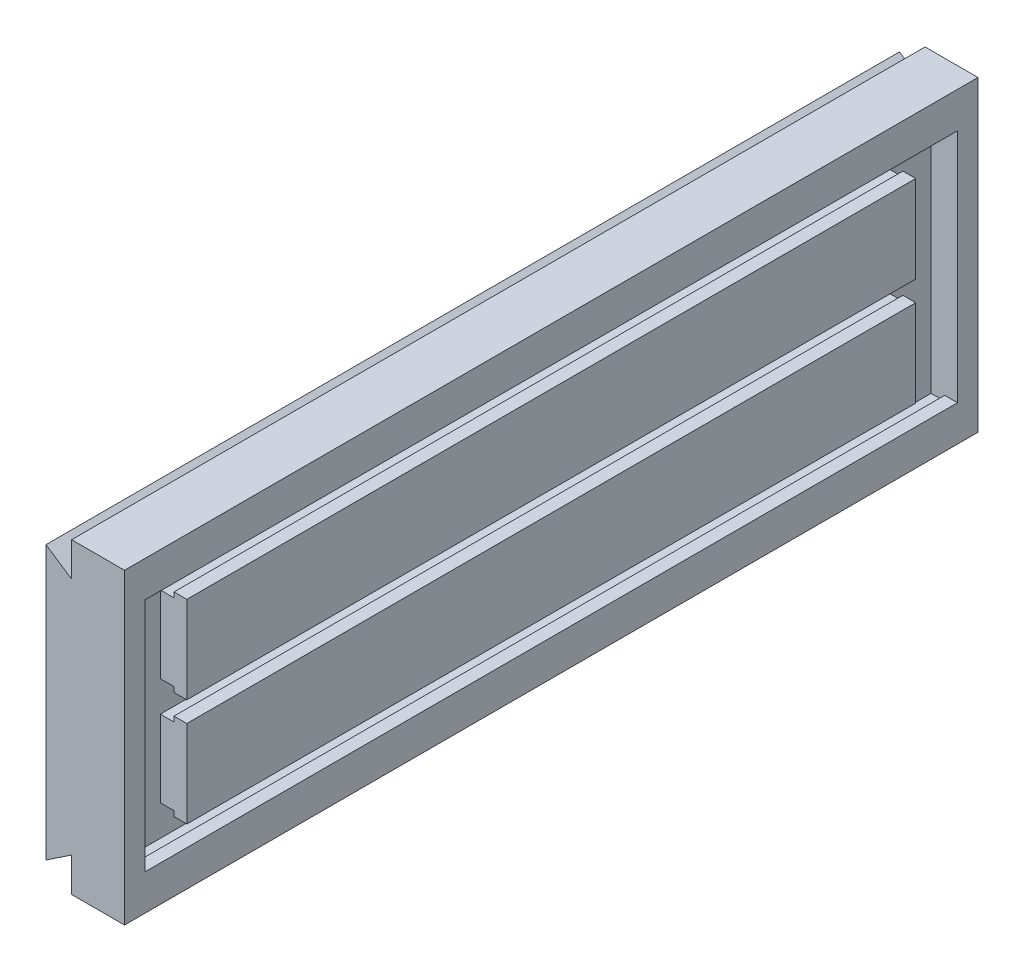
ISO-10303-21;
HEADER;
FILE_DESCRIPTION(('STEP AP214'),'2;1');
FILE_NAME('part.step','',(''),(''),'','','');
FILE_SCHEMA(('AUTOMOTIVE_DESIGN { 1 0 10303 214 1 1 1 1 }'));
ENDSEC;
DATA;
#1=APPLICATION_CONTEXT('core data for automotive mechanical design processes');
#2=APPLICATION_PROTOCOL_DEFINITION('international standard','automotive_design',2000,#1);
#3=PRODUCT_CONTEXT('',#1,'mechanical');
#4=PRODUCT('Part','Part','',(#3));
#5=PRODUCT_RELATED_PRODUCT_CATEGORY('part','',(#4));
#6=PRODUCT_DEFINITION_FORMATION('','',#4);
#7=PRODUCT_DEFINITION_CONTEXT('part definition',#1,'design');
#8=PRODUCT_DEFINITION('design','',#6,#7);
#9=PRODUCT_DEFINITION_SHAPE('','',#8);
#10=(LENGTH_UNIT() NAMED_UNIT(*) SI_UNIT(.MILLI.,.METRE.));
#11=(NAMED_UNIT(*) PLANE_ANGLE_UNIT() SI_UNIT($,.RADIAN.));
#12=(NAMED_UNIT(*) SI_UNIT($,.STERADIAN.) SOLID_ANGLE_UNIT());
#13=UNCERTAINTY_MEASURE_WITH_UNIT(LENGTH_MEASURE(1.E-05),#10,'distance_accuracy_value','');
#14=(GEOMETRIC_REPRESENTATION_CONTEXT(3) GLOBAL_UNCERTAINTY_ASSIGNED_CONTEXT((#13)) GLOBAL_UNIT_ASSIGNED_CONTEXT((#10,
#11,#12)) REPRESENTATION_CONTEXT('',''));
#15=CARTESIAN_POINT('',(0.,0.,0.));
#16=DIRECTION('',(0.,0.,1.));
#17=DIRECTION('',(1.,0.,0.));
#18=AXIS2_PLACEMENT_3D('',#15,#16,#17);
#19=CARTESIAN_POINT('',(0.,90.,250.));
#20=DIRECTION('',(-1.,0.,0.));
#21=DIRECTION('',(0.,0.,1.));
#22=AXIS2_PLACEMENT_3D('',#19,#20,#21);
#23=PLANE('',#22);
#24=DIRECTION('',(0.,1.,0.));
#25=VECTOR('',#24,1.);
#26=CARTESIAN_POINT('',(0.,90.,-250.));
#27=LINE('',#26,#25);
#28=CARTESIAN_POINT('',(0.,-90.,-250.));
#29=VERTEX_POINT('',#28);
#30=CARTESIAN_POINT('',(0.,90.,-250.));
#31=VERTEX_POINT('',#30);
#32=EDGE_CURVE('E311',#29,#31,#27,.T.);
#33=ORIENTED_EDGE('',*,*,#32,.T.);
#34=DIRECTION('',(0.,0.,-1.));
#35=VECTOR('',#34,1.);
#36=CARTESIAN_POINT('',(0.,90.,250.));
#37=LINE('',#36,#35);
#38=CARTESIAN_POINT('',(0.,90.,250.));
#39=VERTEX_POINT('',#38);
#40=EDGE_CURVE('E321',#39,#31,#37,.T.);
#41=ORIENTED_EDGE('',*,*,#40,.F.);
#42=DIRECTION('',(0.,1.,0.));
#43=VECTOR('',#42,1.);
#44=CARTESIAN_POINT('',(0.,90.,250.));
#45=LINE('',#44,#43);
#46=CARTESIAN_POINT('',(0.,-90.,250.));
#47=VERTEX_POINT('',#46);
#48=EDGE_CURVE('E297',#47,#39,#45,.T.);
#49=ORIENTED_EDGE('',*,*,#48,.F.);
#50=DIRECTION('',(0.,0.,-1.));
#51=VECTOR('',#50,1.);
#52=CARTESIAN_POINT('',(0.,-90.,250.));
#53=LINE('',#52,#51);
#54=EDGE_CURVE('E324',#47,#29,#53,.T.);
#55=ORIENTED_EDGE('',*,*,#54,.T.);
#56=EDGE_LOOP('',(#33,#41,#49,#55));
#57=FACE_BOUND('',#56,.T.);
#58=DIRECTION('',(0.,1.,0.));
#59=VECTOR('',#58,1.);
#60=CARTESIAN_POINT('',(0.,57.,-238.));
#61=LINE('',#60,#59);
#62=CARTESIAN_POINT('',(0.,-69.,-238.));
#63=VERTEX_POINT('',#62);
#64=CARTESIAN_POINT('',(0.,69.,-238.));
#65=VERTEX_POINT('',#64);
#66=EDGE_CURVE('E445',#63,#65,#61,.T.);
#67=ORIENTED_EDGE('',*,*,#66,.F.);
#68=DIRECTION('',(0.,0.,1.));
#69=VECTOR('',#68,1.);
#70=CARTESIAN_POINT('',(0.,-69.,-238.));
#71=LINE('',#70,#69);
#72=CARTESIAN_POINT('',(0.,-69.,238.));
#73=VERTEX_POINT('',#72);
#74=EDGE_CURVE('E415',#63,#73,#71,.T.);
#75=ORIENTED_EDGE('',*,*,#74,.T.);
#76=DIRECTION('',(0.,1.,0.));
#77=VECTOR('',#76,1.);
#78=CARTESIAN_POINT('',(0.,57.,238.));
#79=LINE('',#78,#77);
#80=CARTESIAN_POINT('',(0.,69.,238.));
#81=VERTEX_POINT('',#80);
#82=EDGE_CURVE('E431',#73,#81,#79,.T.);
#83=ORIENTED_EDGE('',*,*,#82,.T.);
#84=DIRECTION('',(0.,0.,1.));
#85=VECTOR('',#84,1.);
#86=CARTESIAN_POINT('',(0.,69.,-238.));
#87=LINE('',#86,#85);
#88=EDGE_CURVE('E282',#65,#81,#87,.T.);
#89=ORIENTED_EDGE('',*,*,#88,.F.);
#90=EDGE_LOOP('',(#67,#75,#83,#89));
#91=FACE_BOUND('',#90,.T.);
#92=ADVANCED_FACE('F33',(#57,#91),#23,.F.);
#93=DIRECTION('',(0.,0.,1.));
#94=VECTOR('',#93,1.);
#95=CARTESIAN_POINT('',(0.,-57.,-238.));
#96=LINE('',#95,#94);
#97=CARTESIAN_POINT('',(0.,-57.,-213.5));
#98=VERTEX_POINT('',#97);
#99=CARTESIAN_POINT('',(0.,-57.,213.5));
#100=VERTEX_POINT('',#99);
#101=EDGE_CURVE('E345',#98,#100,#96,.T.);
#102=ORIENTED_EDGE('',*,*,#101,.F.);
#103=DIRECTION('',(0.,-1.,0.));
#104=VECTOR('',#103,1.);
#105=CARTESIAN_POINT('',(0.,69.,-213.5));
#106=LINE('',#105,#104);
#107=CARTESIAN_POINT('',(0.,-6.00000000000001,-213.5));
#108=VERTEX_POINT('',#107);
#109=EDGE_CURVE('E56',#108,#98,#106,.T.);
#110=ORIENTED_EDGE('',*,*,#109,.F.);
#111=DIRECTION('',(0.,0.,1.));
#112=VECTOR('',#111,1.);
#113=CARTESIAN_POINT('',(0.,-6.00000000000001,-238.));
#114=LINE('',#113,#112);
#115=CARTESIAN_POINT('',(0.,-6.00000000000001,213.5));
#116=VERTEX_POINT('',#115);
#117=EDGE_CURVE('E361',#108,#116,#114,.T.);
#118=ORIENTED_EDGE('',*,*,#117,.T.);
#119=DIRECTION('',(0.,1.,0.));
#120=VECTOR('',#119,1.);
#121=CARTESIAN_POINT('',(0.,69.,213.5));
#122=LINE('',#121,#120);
#123=EDGE_CURVE('E353',#100,#116,#122,.T.);
#124=ORIENTED_EDGE('',*,*,#123,.F.);
#125=EDGE_LOOP('',(#102,#110,#118,#124));
#126=FACE_BOUND('',#125,.T.);
#127=ADVANCED_FACE('F359',(#126),#23,.F.);
#128=DIRECTION('',(0.,0.,1.));
#129=VECTOR('',#128,1.);
#130=CARTESIAN_POINT('',(0.,5.99999999999999,-238.));
#131=LINE('',#130,#129);
#132=CARTESIAN_POINT('',(0.,5.99999999999999,-213.5));
#133=VERTEX_POINT('',#132);
#134=CARTESIAN_POINT('',(0.,5.99999999999999,213.5));
#135=VERTEX_POINT('',#134);
#136=EDGE_CURVE('E254',#133,#135,#131,.T.);
#137=ORIENTED_EDGE('',*,*,#136,.F.);
#138=CARTESIAN_POINT('',(0.,57.,-213.5));
#139=VERTEX_POINT('',#138);
#140=EDGE_CURVE('E48',#139,#133,#106,.T.);
#141=ORIENTED_EDGE('',*,*,#140,.F.);
#142=DIRECTION('',(0.,0.,1.));
#143=VECTOR('',#142,1.);
#144=CARTESIAN_POINT('',(0.,57.,-238.));
#145=LINE('',#144,#143);
#146=CARTESIAN_POINT('',(0.,57.,213.5));
#147=VERTEX_POINT('',#146);
#148=EDGE_CURVE('E252',#139,#147,#145,.T.);
#149=ORIENTED_EDGE('',*,*,#148,.T.);
#150=EDGE_CURVE('E246',#135,#147,#122,.T.);
#151=ORIENTED_EDGE('',*,*,#150,.F.);
#152=EDGE_LOOP('',(#137,#141,#149,#151));
#153=FACE_BOUND('',#152,.T.);
#154=ADVANCED_FACE('F250',(#153),#23,.F.);
#155=CARTESIAN_POINT('',(-31.,70.,250.));
#156=DIRECTION('',(-0.554700196225229,-0.832050294337843,0.));
#157=DIRECTION('',(0.832050294337843,-0.554700196225229,0.));
#158=AXIS2_PLACEMENT_3D('',#155,#156,#157);
#159=PLANE('',#158);
#160=DIRECTION('',(-0.832050294337843,0.554700196225229,0.));
#161=VECTOR('',#160,1.);
#162=CARTESIAN_POINT('',(-31.,70.,-250.));
#163=LINE('',#162,#161);
#164=CARTESIAN_POINT('',(-31.,70.,-250.));
#165=VERTEX_POINT('',#164);
#166=CARTESIAN_POINT('',(-46.,80.,-250.));
#167=VERTEX_POINT('',#166);
#168=EDGE_CURVE('E261',#165,#167,#163,.T.);
#169=ORIENTED_EDGE('',*,*,#168,.T.);
#170=DIRECTION('',(0.,0.,-1.));
#171=VECTOR('',#170,1.);
#172=CARTESIAN_POINT('',(-46.,80.,250.));
#173=LINE('',#172,#171);
#174=CARTESIAN_POINT('',(-46.,80.,250.));
#175=VERTEX_POINT('',#174);
#176=EDGE_CURVE('E336',#175,#167,#173,.T.);
#177=ORIENTED_EDGE('',*,*,#176,.F.);
#178=DIRECTION('',(-0.832050294337843,0.554700196225229,0.));
#179=VECTOR('',#178,1.);
#180=CARTESIAN_POINT('',(-31.,70.,250.));
#181=LINE('',#180,#179);
#182=CARTESIAN_POINT('',(-31.,70.,250.));
#183=VERTEX_POINT('',#182);
#184=EDGE_CURVE('E285',#183,#175,#181,.T.);
#185=ORIENTED_EDGE('',*,*,#184,.F.);
#186=DIRECTION('',(0.,0.,-1.));
#187=VECTOR('',#186,1.);
#188=CARTESIAN_POINT('',(-31.,70.,250.));
#189=LINE('',#188,#187);
#190=EDGE_CURVE('E302',#183,#165,#189,.T.);
#191=ORIENTED_EDGE('',*,*,#190,.T.);
#192=EDGE_LOOP('',(#169,#177,#185,#191));
#193=FACE_BOUND('',#192,.T.);
#194=ADVANCED_FACE('F35',(#193),#159,.F.);
#195=CARTESIAN_POINT('',(-46.,80.,250.));
#196=DIRECTION('',(1.,0.,0.));
#197=DIRECTION('',(0.,1.,0.));
#198=AXIS2_PLACEMENT_3D('',#195,#196,#197);
#199=PLANE('',#198);
#200=DIRECTION('',(0.,-1.,0.));
#201=VECTOR('',#200,1.);
#202=CARTESIAN_POINT('',(-46.,80.,-250.));
#203=LINE('',#202,#201);
#204=CARTESIAN_POINT('',(-46.,-80.,-250.));
#205=VERTEX_POINT('',#204);
#206=EDGE_CURVE('E265',#167,#205,#203,.T.);
#207=ORIENTED_EDGE('',*,*,#206,.T.);
#208=DIRECTION('',(0.,0.,-1.));
#209=VECTOR('',#208,1.);
#210=CARTESIAN_POINT('',(-46.,-80.,250.));
#211=LINE('',#210,#209);
#212=CARTESIAN_POINT('',(-46.,-80.,250.));
#213=VERTEX_POINT('',#212);
#214=EDGE_CURVE('E333',#213,#205,#211,.T.);
#215=ORIENTED_EDGE('',*,*,#214,.F.);
#216=DIRECTION('',(0.,-1.,0.));
#217=VECTOR('',#216,1.);
#218=CARTESIAN_POINT('',(-46.,80.,250.));
#219=LINE('',#218,#217);
#220=EDGE_CURVE('E288',#175,#213,#219,.T.);
#221=ORIENTED_EDGE('',*,*,#220,.F.);
#222=ORIENTED_EDGE('',*,*,#176,.T.);
#223=EDGE_LOOP('',(#207,#215,#221,#222));
#224=FACE_BOUND('',#223,.T.);
#225=ADVANCED_FACE('F528',(#224),#199,.F.);
#226=CARTESIAN_POINT('',(-46.,-80.,250.));
#227=DIRECTION('',(-0.55470019622523,0.832050294337843,0.));
#228=DIRECTION('',(-0.832050294337843,-0.55470019622523,0.));
#229=AXIS2_PLACEMENT_3D('',#226,#227,#228);
#230=PLANE('',#229);
#231=DIRECTION('',(0.832050294337843,0.55470019622523,0.));
#232=VECTOR('',#231,1.);
#233=CARTESIAN_POINT('',(-46.,-80.,-250.));
#234=LINE('',#233,#232);
#235=CARTESIAN_POINT('',(-31.,-70.,-250.));
#236=VERTEX_POINT('',#235);
#237=EDGE_CURVE('E305',#205,#236,#234,.T.);
#238=ORIENTED_EDGE('',*,*,#237,.T.);
#239=DIRECTION('',(0.,0.,-1.));
#240=VECTOR('',#239,1.);
#241=CARTESIAN_POINT('',(-31.,-70.,250.));
#242=LINE('',#241,#240);
#243=CARTESIAN_POINT('',(-31.,-70.,250.));
#244=VERTEX_POINT('',#243);
#245=EDGE_CURVE('E330',#244,#236,#242,.T.);
#246=ORIENTED_EDGE('',*,*,#245,.F.);
#247=DIRECTION('',(0.832050294337843,0.55470019622523,0.));
#248=VECTOR('',#247,1.);
#249=CARTESIAN_POINT('',(-46.,-80.,250.));
#250=LINE('',#249,#248);
#251=EDGE_CURVE('E291',#213,#244,#250,.T.);
#252=ORIENTED_EDGE('',*,*,#251,.F.);
#253=ORIENTED_EDGE('',*,*,#214,.T.);
#254=EDGE_LOOP('',(#238,#246,#252,#253));
#255=FACE_BOUND('',#254,.T.);
#256=ADVANCED_FACE('F533',(#255),#230,.F.);
#257=CARTESIAN_POINT('',(-31.,-70.,250.));
#258=DIRECTION('',(1.,0.,0.));
#259=DIRECTION('',(0.,1.,0.));
#260=AXIS2_PLACEMENT_3D('',#257,#258,#259);
#261=PLANE('',#260);
#262=DIRECTION('',(0.,-1.,0.));
#263=VECTOR('',#262,1.);
#264=CARTESIAN_POINT('',(-31.,-70.,-250.));
#265=LINE('',#264,#263);
#266=CARTESIAN_POINT('',(-31.,-90.,-250.));
#267=VERTEX_POINT('',#266);
#268=EDGE_CURVE('E307',#236,#267,#265,.T.);
#269=ORIENTED_EDGE('',*,*,#268,.T.);
#270=DIRECTION('',(0.,0.,-1.));
#271=VECTOR('',#270,1.);
#272=CARTESIAN_POINT('',(-31.,-90.,250.));
#273=LINE('',#272,#271);
#274=CARTESIAN_POINT('',(-31.,-90.,250.));
#275=VERTEX_POINT('',#274);
#276=EDGE_CURVE('E327',#275,#267,#273,.T.);
#277=ORIENTED_EDGE('',*,*,#276,.F.);
#278=DIRECTION('',(0.,-1.,0.));
#279=VECTOR('',#278,1.);
#280=CARTESIAN_POINT('',(-31.,-70.,250.));
#281=LINE('',#280,#279);
#282=EDGE_CURVE('E293',#244,#275,#281,.T.);
#283=ORIENTED_EDGE('',*,*,#282,.F.);
#284=ORIENTED_EDGE('',*,*,#245,.T.);
#285=EDGE_LOOP('',(#269,#277,#283,#284));
#286=FACE_BOUND('',#285,.T.);
#287=ADVANCED_FACE('F567',(#286),#261,.F.);
#288=CARTESIAN_POINT('',(0.,-90.,250.));
#289=DIRECTION('',(0.,1.,0.));
#290=DIRECTION('',(0.,0.,1.));
#291=AXIS2_PLACEMENT_3D('',#288,#289,#290);
#292=PLANE('',#291);
#293=DIRECTION('',(1.,0.,0.));
#294=VECTOR('',#293,1.);
#295=CARTESIAN_POINT('',(0.,-90.,-250.));
#296=LINE('',#295,#294);
#297=EDGE_CURVE('E309',#267,#29,#296,.T.);
#298=ORIENTED_EDGE('',*,*,#297,.T.);
#299=ORIENTED_EDGE('',*,*,#54,.F.);
#300=DIRECTION('',(1.,0.,0.));
#301=VECTOR('',#300,1.);
#302=CARTESIAN_POINT('',(0.,-90.,250.));
#303=LINE('',#302,#301);
#304=EDGE_CURVE('E295',#275,#47,#303,.T.);
#305=ORIENTED_EDGE('',*,*,#304,.F.);
#306=ORIENTED_EDGE('',*,*,#276,.T.);
#307=EDGE_LOOP('',(#298,#299,#305,#306));
#308=FACE_BOUND('',#307,.T.);
#309=ADVANCED_FACE('F563',(#308),#292,.F.);
#310=CARTESIAN_POINT('',(-31.,90.,250.));
#311=DIRECTION('',(0.,-1.,0.));
#312=DIRECTION('',(0.,0.,-1.));
#313=AXIS2_PLACEMENT_3D('',#310,#311,#312);
#314=PLANE('',#313);
#315=DIRECTION('',(-1.,0.,0.));
#316=VECTOR('',#315,1.);
#317=CARTESIAN_POINT('',(-31.,90.,-250.));
#318=LINE('',#317,#316);
#319=CARTESIAN_POINT('',(-31.,90.,-250.));
#320=VERTEX_POINT('',#319);
#321=EDGE_CURVE('E313',#31,#320,#318,.T.);
#322=ORIENTED_EDGE('',*,*,#321,.T.);
#323=DIRECTION('',(0.,0.,-1.));
#324=VECTOR('',#323,1.);
#325=CARTESIAN_POINT('',(-31.,90.,250.));
#326=LINE('',#325,#324);
#327=CARTESIAN_POINT('',(-31.,90.,250.));
#328=VERTEX_POINT('',#327);
#329=EDGE_CURVE('E318',#328,#320,#326,.T.);
#330=ORIENTED_EDGE('',*,*,#329,.F.);
#331=DIRECTION('',(-1.,0.,0.));
#332=VECTOR('',#331,1.);
#333=CARTESIAN_POINT('',(-31.,90.,250.));
#334=LINE('',#333,#332);
#335=EDGE_CURVE('E299',#39,#328,#334,.T.);
#336=ORIENTED_EDGE('',*,*,#335,.F.);
#337=ORIENTED_EDGE('',*,*,#40,.T.);
#338=EDGE_LOOP('',(#322,#330,#336,#337));
#339=FACE_BOUND('',#338,.T.);
#340=ADVANCED_FACE('F555',(#339),#314,.F.);
#341=CARTESIAN_POINT('',(-31.,90.,250.));
#342=DIRECTION('',(1.,0.,0.));
#343=DIRECTION('',(0.,0.,-1.));
#344=AXIS2_PLACEMENT_3D('',#341,#342,#343);
#345=PLANE('',#344);
#346=DIRECTION('',(0.,-1.,0.));
#347=VECTOR('',#346,1.);
#348=CARTESIAN_POINT('',(-31.,90.,-250.));
#349=LINE('',#348,#347);
#350=EDGE_CURVE('E289',#320,#165,#349,.T.);
#351=ORIENTED_EDGE('',*,*,#350,.T.);
#352=ORIENTED_EDGE('',*,*,#190,.F.);
#353=DIRECTION('',(0.,-1.,0.));
#354=VECTOR('',#353,1.);
#355=CARTESIAN_POINT('',(-31.,90.,250.));
#356=LINE('',#355,#354);
#357=EDGE_CURVE('E301',#328,#183,#356,.T.);
#358=ORIENTED_EDGE('',*,*,#357,.F.);
#359=ORIENTED_EDGE('',*,*,#329,.T.);
#360=EDGE_LOOP('',(#351,#352,#358,#359));
#361=FACE_BOUND('',#360,.T.);
#362=ADVANCED_FACE('F553',(#361),#345,.F.);
#363=CARTESIAN_POINT('',(0.,0.,250.));
#364=DIRECTION('',(0.,0.,-1.));
#365=DIRECTION('',(-1.,0.,0.));
#366=AXIS2_PLACEMENT_3D('',#363,#364,#365);
#367=PLANE('',#366);
#368=ORIENTED_EDGE('',*,*,#184,.T.);
#369=ORIENTED_EDGE('',*,*,#220,.T.);
#370=ORIENTED_EDGE('',*,*,#251,.T.);
#371=ORIENTED_EDGE('',*,*,#282,.T.);
#372=ORIENTED_EDGE('',*,*,#304,.T.);
#373=ORIENTED_EDGE('',*,*,#48,.T.);
#374=ORIENTED_EDGE('',*,*,#335,.T.);
#375=ORIENTED_EDGE('',*,*,#357,.T.);
#376=EDGE_LOOP('',(#368,#369,#370,#371,#372,#373,#374,#375));
#377=FACE_BOUND('',#376,.T.);
#378=ADVANCED_FACE('F548',(#377),#367,.F.);
#379=CARTESIAN_POINT('',(0.,0.,-250.));
#380=DIRECTION('',(0.,0.,-1.));
#381=DIRECTION('',(-1.,0.,0.));
#382=AXIS2_PLACEMENT_3D('',#379,#380,#381);
#383=PLANE('',#382);
#384=ORIENTED_EDGE('',*,*,#168,.F.);
#385=ORIENTED_EDGE('',*,*,#350,.F.);
#386=ORIENTED_EDGE('',*,*,#321,.F.);
#387=ORIENTED_EDGE('',*,*,#32,.F.);
#388=ORIENTED_EDGE('',*,*,#297,.F.);
#389=ORIENTED_EDGE('',*,*,#268,.F.);
#390=ORIENTED_EDGE('',*,*,#237,.F.);
#391=ORIENTED_EDGE('',*,*,#206,.F.);
#392=EDGE_LOOP('',(#384,#385,#386,#387,#388,#389,#390,#391));
#393=FACE_BOUND('',#392,.T.);
#394=ADVANCED_FACE('F541',(#393),#383,.T.);
#395=CARTESIAN_POINT('',(-7.5,57.,-238.));
#396=DIRECTION('',(0.,-1.,0.));
#397=DIRECTION('',(0.,0.,-1.));
#398=AXIS2_PLACEMENT_3D('',#395,#396,#397);
#399=PLANE('',#398);
#400=ORIENTED_EDGE('',*,*,#148,.F.);
#401=DIRECTION('',(-1.,0.,0.));
#402=VECTOR('',#401,1.);
#403=CARTESIAN_POINT('',(-7.5,57.,-213.5));
#404=LINE('',#403,#402);
#405=CARTESIAN_POINT('',(-7.5,57.,-213.5));
#406=VERTEX_POINT('',#405);
#407=EDGE_CURVE('E239',#139,#406,#404,.T.);
#408=ORIENTED_EDGE('',*,*,#407,.T.);
#409=DIRECTION('',(0.,0.,1.));
#410=VECTOR('',#409,1.);
#411=CARTESIAN_POINT('',(-7.5,57.,-238.));
#412=LINE('',#411,#410);
#413=CARTESIAN_POINT('',(-7.5,57.,213.5));
#414=VERTEX_POINT('',#413);
#415=EDGE_CURVE('E262',#406,#414,#412,.T.);
#416=ORIENTED_EDGE('',*,*,#415,.T.);
#417=DIRECTION('',(1.,0.,0.));
#418=VECTOR('',#417,1.);
#419=CARTESIAN_POINT('',(-7.5,57.,213.5));
#420=LINE('',#419,#418);
#421=EDGE_CURVE('E260',#414,#147,#420,.T.);
#422=ORIENTED_EDGE('',*,*,#421,.T.);
#423=EDGE_LOOP('',(#400,#408,#416,#422));
#424=FACE_BOUND('',#423,.T.);
#425=ADVANCED_FACE('F258',(#424),#399,.F.);
#426=CARTESIAN_POINT('',(-7.5,54.,-238.));
#427=DIRECTION('',(1.,0.,0.));
#428=DIRECTION('',(0.,0.,-1.));
#429=AXIS2_PLACEMENT_3D('',#426,#427,#428);
#430=PLANE('',#429);
#431=ORIENTED_EDGE('',*,*,#415,.F.);
#432=DIRECTION('',(0.,-1.,0.));
#433=VECTOR('',#432,1.);
#434=CARTESIAN_POINT('',(-7.5,54.,-213.5));
#435=LINE('',#434,#433);
#436=CARTESIAN_POINT('',(-7.5,54.,-213.5));
#437=VERTEX_POINT('',#436);
#438=EDGE_CURVE('E242',#406,#437,#435,.T.);
#439=ORIENTED_EDGE('',*,*,#438,.T.);
#440=DIRECTION('',(0.,0.,1.));
#441=VECTOR('',#440,1.);
#442=CARTESIAN_POINT('',(-7.5,54.,-238.));
#443=LINE('',#442,#441);
#444=CARTESIAN_POINT('',(-7.5,54.,213.5));
#445=VERTEX_POINT('',#444);
#446=EDGE_CURVE('E267',#437,#445,#443,.T.);
#447=ORIENTED_EDGE('',*,*,#446,.T.);
#448=DIRECTION('',(0.,1.,0.));
#449=VECTOR('',#448,1.);
#450=CARTESIAN_POINT('',(-7.5,53.9999999999999,213.5));
#451=LINE('',#450,#449);
#452=EDGE_CURVE('E393',#445,#414,#451,.T.);
#453=ORIENTED_EDGE('',*,*,#452,.T.);
#454=EDGE_LOOP('',(#431,#439,#447,#453));
#455=FACE_BOUND('',#454,.T.);
#456=ADVANCED_FACE('F601',(#455),#430,.F.);
#457=CARTESIAN_POINT('',(-15.5,54.,-238.));
#458=DIRECTION('',(0.,-1.,0.));
#459=DIRECTION('',(1.,0.,0.));
#460=AXIS2_PLACEMENT_3D('',#457,#458,#459);
#461=PLANE('',#460);
#462=ORIENTED_EDGE('',*,*,#446,.F.);
#463=DIRECTION('',(-1.,0.,0.));
#464=VECTOR('',#463,1.);
#465=CARTESIAN_POINT('',(-15.5,54.,-213.5));
#466=LINE('',#465,#464);
#467=CARTESIAN_POINT('',(-15.5,54.,-213.5));
#468=VERTEX_POINT('',#467);
#469=EDGE_CURVE('E891',#437,#468,#466,.T.);
#470=ORIENTED_EDGE('',*,*,#469,.T.);
#471=DIRECTION('',(0.,0.,1.));
#472=VECTOR('',#471,1.);
#473=CARTESIAN_POINT('',(-15.5,54.,-238.));
#474=LINE('',#473,#472);
#475=CARTESIAN_POINT('',(-15.5,54.,213.5));
#476=VERTEX_POINT('',#475);
#477=EDGE_CURVE('E274',#468,#476,#474,.T.);
#478=ORIENTED_EDGE('',*,*,#477,.T.);
#479=DIRECTION('',(1.,0.,0.));
#480=VECTOR('',#479,1.);
#481=CARTESIAN_POINT('',(-15.5,54.,213.5));
#482=LINE('',#481,#480);
#483=EDGE_CURVE('E390',#476,#445,#482,.T.);
#484=ORIENTED_EDGE('',*,*,#483,.T.);
#485=EDGE_LOOP('',(#462,#470,#478,#484));
#486=FACE_BOUND('',#485,.T.);
#487=ADVANCED_FACE('F597',(#486),#461,.F.);
#488=CARTESIAN_POINT('',(-15.5,72.,-238.));
#489=DIRECTION('',(-1.,0.,0.));
#490=DIRECTION('',(0.,0.,1.));
#491=AXIS2_PLACEMENT_3D('',#488,#489,#490);
#492=PLANE('',#491);
#493=ORIENTED_EDGE('',*,*,#477,.F.);
#494=DIRECTION('',(0.,-1.,0.));
#495=VECTOR('',#494,1.);
#496=CARTESIAN_POINT('',(-15.5,69.,-213.5));
#497=LINE('',#496,#495);
#498=CARTESIAN_POINT('',(-15.5,8.99999999999998,-213.5));
#499=VERTEX_POINT('',#498);
#500=EDGE_CURVE('E893',#468,#499,#497,.T.);
#501=ORIENTED_EDGE('',*,*,#500,.T.);
#502=DIRECTION('',(0.,0.,1.));
#503=VECTOR('',#502,1.);
#504=CARTESIAN_POINT('',(-15.5,8.99999999999999,-238.));
#505=LINE('',#504,#503);
#506=CARTESIAN_POINT('',(-15.5,8.99999999999998,213.5));
#507=VERTEX_POINT('',#506);
#508=EDGE_CURVE('E438',#499,#507,#505,.T.);
#509=ORIENTED_EDGE('',*,*,#508,.T.);
#510=DIRECTION('',(0.,1.,0.));
#511=VECTOR('',#510,1.);
#512=CARTESIAN_POINT('',(-15.5,69.,213.5));
#513=LINE('',#512,#511);
#514=EDGE_CURVE('E362',#507,#476,#513,.T.);
#515=ORIENTED_EDGE('',*,*,#514,.T.);
#516=EDGE_LOOP('',(#493,#501,#509,#515));
#517=FACE_BOUND('',#516,.T.);
#518=DIRECTION('',(0.,0.,1.));
#519=VECTOR('',#518,1.);
#520=CARTESIAN_POINT('',(-15.5,-72.,-238.));
#521=LINE('',#520,#519);
#522=CARTESIAN_POINT('',(-15.5,-72.,-238.));
#523=VERTEX_POINT('',#522);
#524=CARTESIAN_POINT('',(-15.5,-72.,238.));
#525=VERTEX_POINT('',#524);
#526=EDGE_CURVE('E421',#523,#525,#521,.T.);
#527=ORIENTED_EDGE('',*,*,#526,.F.);
#528=DIRECTION('',(0.,-1.,0.));
#529=VECTOR('',#528,1.);
#530=CARTESIAN_POINT('',(-15.5,72.,-238.));
#531=LINE('',#530,#529);
#532=CARTESIAN_POINT('',(-15.5,72.,-238.));
#533=VERTEX_POINT('',#532);
#534=EDGE_CURVE('E284',#533,#523,#531,.T.);
#535=ORIENTED_EDGE('',*,*,#534,.F.);
#536=DIRECTION('',(0.,0.,1.));
#537=VECTOR('',#536,1.);
#538=CARTESIAN_POINT('',(-15.5,72.,-238.));
#539=LINE('',#538,#537);
#540=CARTESIAN_POINT('',(-15.5,72.,238.));
#541=VERTEX_POINT('',#540);
#542=EDGE_CURVE('E276',#533,#541,#539,.T.);
#543=ORIENTED_EDGE('',*,*,#542,.T.);
#544=DIRECTION('',(0.,-1.,0.));
#545=VECTOR('',#544,1.);
#546=CARTESIAN_POINT('',(-15.5,72.,238.));
#547=LINE('',#546,#545);
#548=EDGE_CURVE('E270',#541,#525,#547,.T.);
#549=ORIENTED_EDGE('',*,*,#548,.T.);
#550=EDGE_LOOP('',(#527,#535,#543,#549));
#551=FACE_BOUND('',#550,.T.);
#552=CARTESIAN_POINT('',(-15.5,-8.99999999999999,-213.5));
#553=VERTEX_POINT('',#552);
#554=CARTESIAN_POINT('',(-15.5,-54.,-213.5));
#555=VERTEX_POINT('',#554);
#556=EDGE_CURVE('E255',#553,#555,#497,.T.);
#557=ORIENTED_EDGE('',*,*,#556,.T.);
#558=DIRECTION('',(0.,0.,1.));
#559=VECTOR('',#558,1.);
#560=CARTESIAN_POINT('',(-15.5,-54.,-238.));
#561=LINE('',#560,#559);
#562=CARTESIAN_POINT('',(-15.5,-54.,213.5));
#563=VERTEX_POINT('',#562);
#564=EDGE_CURVE('E424',#555,#563,#561,.T.);
#565=ORIENTED_EDGE('',*,*,#564,.T.);
#566=CARTESIAN_POINT('',(-15.5,-9.00000000000001,213.5));
#567=VERTEX_POINT('',#566);
#568=EDGE_CURVE('E365',#563,#567,#513,.T.);
#569=ORIENTED_EDGE('',*,*,#568,.T.);
#570=DIRECTION('',(0.,0.,1.));
#571=VECTOR('',#570,1.);
#572=CARTESIAN_POINT('',(-15.5,-9.,-238.));
#573=LINE('',#572,#571);
#574=EDGE_CURVE('E436',#553,#567,#573,.T.);
#575=ORIENTED_EDGE('',*,*,#574,.F.);
#576=EDGE_LOOP('',(#557,#565,#569,#575));
#577=FACE_BOUND('',#576,.T.);
#578=ADVANCED_FACE('F472',(#517,#551,#577),#492,.F.);
#579=CARTESIAN_POINT('',(-7.5,72.,-238.));
#580=DIRECTION('',(0.,1.,0.));
#581=DIRECTION('',(-1.,0.,0.));
#582=AXIS2_PLACEMENT_3D('',#579,#580,#581);
#583=PLANE('',#582);
#584=DIRECTION('',(-1.,0.,0.));
#585=VECTOR('',#584,1.);
#586=CARTESIAN_POINT('',(-7.5,72.,238.));
#587=LINE('',#586,#585);
#588=CARTESIAN_POINT('',(-7.5,72.,238.));
#589=VERTEX_POINT('',#588);
#590=EDGE_CURVE('E465',#589,#541,#587,.T.);
#591=ORIENTED_EDGE('',*,*,#590,.T.);
#592=ORIENTED_EDGE('',*,*,#542,.F.);
#593=DIRECTION('',(-1.,0.,0.));
#594=VECTOR('',#593,1.);
#595=CARTESIAN_POINT('',(-7.5,72.,-238.));
#596=LINE('',#595,#594);
#597=CARTESIAN_POINT('',(-7.5,72.,-238.));
#598=VERTEX_POINT('',#597);
#599=EDGE_CURVE('E454',#598,#533,#596,.T.);
#600=ORIENTED_EDGE('',*,*,#599,.F.);
#601=DIRECTION('',(0.,0.,1.));
#602=VECTOR('',#601,1.);
#603=CARTESIAN_POINT('',(-7.5,72.,-238.));
#604=LINE('',#603,#602);
#605=EDGE_CURVE('E278',#598,#589,#604,.T.);
#606=ORIENTED_EDGE('',*,*,#605,.T.);
#607=EDGE_LOOP('',(#591,#592,#600,#606));
#608=FACE_BOUND('',#607,.T.);
#609=ADVANCED_FACE('F492',(#608),#583,.F.);
#610=CARTESIAN_POINT('',(-7.5,69.,-238.));
#611=DIRECTION('',(1.,0.,0.));
#612=DIRECTION('',(0.,0.,-1.));
#613=AXIS2_PLACEMENT_3D('',#610,#611,#612);
#614=PLANE('',#613);
#615=DIRECTION('',(0.,1.,0.));
#616=VECTOR('',#615,1.);
#617=CARTESIAN_POINT('',(-7.5,69.,238.));
#618=LINE('',#617,#616);
#619=CARTESIAN_POINT('',(-7.5,69.,238.));
#620=VERTEX_POINT('',#619);
#621=EDGE_CURVE('E463',#620,#589,#618,.T.);
#622=ORIENTED_EDGE('',*,*,#621,.T.);
#623=ORIENTED_EDGE('',*,*,#605,.F.);
#624=DIRECTION('',(0.,1.,0.));
#625=VECTOR('',#624,1.);
#626=CARTESIAN_POINT('',(-7.5,69.,-238.));
#627=LINE('',#626,#625);
#628=CARTESIAN_POINT('',(-7.5,69.,-238.));
#629=VERTEX_POINT('',#628);
#630=EDGE_CURVE('E451',#629,#598,#627,.T.);
#631=ORIENTED_EDGE('',*,*,#630,.F.);
#632=DIRECTION('',(0.,0.,1.));
#633=VECTOR('',#632,1.);
#634=CARTESIAN_POINT('',(-7.5,69.,-238.));
#635=LINE('',#634,#633);
#636=EDGE_CURVE('E280',#629,#620,#635,.T.);
#637=ORIENTED_EDGE('',*,*,#636,.T.);
#638=EDGE_LOOP('',(#622,#623,#631,#637));
#639=FACE_BOUND('',#638,.T.);
#640=ADVANCED_FACE('F496',(#639),#614,.F.);
#641=CARTESIAN_POINT('',(0.,69.,-238.));
#642=DIRECTION('',(0.,1.,0.));
#643=DIRECTION('',(0.,0.,1.));
#644=AXIS2_PLACEMENT_3D('',#641,#642,#643);
#645=PLANE('',#644);
#646=DIRECTION('',(-1.,0.,0.));
#647=VECTOR('',#646,1.);
#648=CARTESIAN_POINT('',(0.,69.,238.));
#649=LINE('',#648,#647);
#650=EDGE_CURVE('E460',#81,#620,#649,.T.);
#651=ORIENTED_EDGE('',*,*,#650,.T.);
#652=ORIENTED_EDGE('',*,*,#636,.F.);
#653=DIRECTION('',(-1.,0.,0.));
#654=VECTOR('',#653,1.);
#655=CARTESIAN_POINT('',(0.,69.,-238.));
#656=LINE('',#655,#654);
#657=EDGE_CURVE('E448',#65,#629,#656,.T.);
#658=ORIENTED_EDGE('',*,*,#657,.F.);
#659=ORIENTED_EDGE('',*,*,#88,.T.);
#660=EDGE_LOOP('',(#651,#652,#658,#659));
#661=FACE_BOUND('',#660,.T.);
#662=ADVANCED_FACE('F498',(#661),#645,.F.);
#663=CARTESIAN_POINT('',(0.,0.,-238.));
#664=DIRECTION('',(0.,0.,1.));
#665=DIRECTION('',(1.,0.,0.));
#666=AXIS2_PLACEMENT_3D('',#663,#664,#665);
#667=PLANE('',#666);
#668=DIRECTION('',(1.,0.,0.));
#669=VECTOR('',#668,1.);
#670=CARTESIAN_POINT('',(0.,-69.,-238.));
#671=LINE('',#670,#669);
#672=CARTESIAN_POINT('',(-7.50000000000001,-69.,-238.));
#673=VERTEX_POINT('',#672);
#674=EDGE_CURVE('E405',#673,#63,#671,.T.);
#675=ORIENTED_EDGE('',*,*,#674,.T.);
#676=ORIENTED_EDGE('',*,*,#66,.T.);
#677=ORIENTED_EDGE('',*,*,#657,.T.);
#678=ORIENTED_EDGE('',*,*,#630,.T.);
#679=ORIENTED_EDGE('',*,*,#599,.T.);
#680=ORIENTED_EDGE('',*,*,#534,.T.);
#681=DIRECTION('',(1.,0.,0.));
#682=VECTOR('',#681,1.);
#683=CARTESIAN_POINT('',(-7.50000000000001,-72.,-238.));
#684=LINE('',#683,#682);
#685=CARTESIAN_POINT('',(-7.50000000000001,-72.,-238.));
#686=VERTEX_POINT('',#685);
#687=EDGE_CURVE('E398',#523,#686,#684,.T.);
#688=ORIENTED_EDGE('',*,*,#687,.T.);
#689=DIRECTION('',(0.,1.,0.));
#690=VECTOR('',#689,1.);
#691=CARTESIAN_POINT('',(-7.50000000000001,-69.,-238.));
#692=LINE('',#691,#690);
#693=EDGE_CURVE('E401',#686,#673,#692,.T.);
#694=ORIENTED_EDGE('',*,*,#693,.T.);
#695=EDGE_LOOP('',(#675,#676,#677,#678,#679,#680,#688,#694));
#696=FACE_BOUND('',#695,.T.);
#697=ADVANCED_FACE('F489',(#696),#667,.T.);
#698=CARTESIAN_POINT('',(0.,0.,238.));
#699=DIRECTION('',(0.,0.,1.));
#700=DIRECTION('',(1.,0.,0.));
#701=AXIS2_PLACEMENT_3D('',#698,#699,#700);
#702=PLANE('',#701);
#703=ORIENTED_EDGE('',*,*,#82,.F.);
#704=DIRECTION('',(1.,0.,0.));
#705=VECTOR('',#704,1.);
#706=CARTESIAN_POINT('',(0.,-69.,238.));
#707=LINE('',#706,#705);
#708=CARTESIAN_POINT('',(-7.50000000000001,-69.,238.));
#709=VERTEX_POINT('',#708);
#710=EDGE_CURVE('E402',#709,#73,#707,.T.);
#711=ORIENTED_EDGE('',*,*,#710,.F.);
#712=DIRECTION('',(0.,1.,0.));
#713=VECTOR('',#712,1.);
#714=CARTESIAN_POINT('',(-7.50000000000001,-69.,238.));
#715=LINE('',#714,#713);
#716=CARTESIAN_POINT('',(-7.50000000000001,-72.,238.));
#717=VERTEX_POINT('',#716);
#718=EDGE_CURVE('E410',#717,#709,#715,.T.);
#719=ORIENTED_EDGE('',*,*,#718,.F.);
#720=DIRECTION('',(1.,0.,0.));
#721=VECTOR('',#720,1.);
#722=CARTESIAN_POINT('',(-7.50000000000001,-72.,238.));
#723=LINE('',#722,#721);
#724=EDGE_CURVE('E397',#525,#717,#723,.T.);
#725=ORIENTED_EDGE('',*,*,#724,.F.);
#726=ORIENTED_EDGE('',*,*,#548,.F.);
#727=ORIENTED_EDGE('',*,*,#590,.F.);
#728=ORIENTED_EDGE('',*,*,#621,.F.);
#729=ORIENTED_EDGE('',*,*,#650,.F.);
#730=EDGE_LOOP('',(#703,#711,#719,#725,#726,#727,#728,#729));
#731=FACE_BOUND('',#730,.T.);
#732=ADVANCED_FACE('F482',(#731),#702,.F.);
#733=CARTESIAN_POINT('',(-7.5,-6.00000000000001,-238.));
#734=DIRECTION('',(0.,-1.,0.));
#735=DIRECTION('',(0.,0.,-1.));
#736=AXIS2_PLACEMENT_3D('',#733,#734,#735);
#737=PLANE('',#736);
#738=ORIENTED_EDGE('',*,*,#117,.F.);
#739=DIRECTION('',(-1.,0.,0.));
#740=VECTOR('',#739,1.);
#741=CARTESIAN_POINT('',(-7.5,-6.00000000000001,-213.5));
#742=LINE('',#741,#740);
#743=CARTESIAN_POINT('',(-7.5,-6.00000000000001,-213.5));
#744=VERTEX_POINT('',#743);
#745=EDGE_CURVE('E920',#108,#744,#742,.T.);
#746=ORIENTED_EDGE('',*,*,#745,.T.);
#747=DIRECTION('',(0.,0.,1.));
#748=VECTOR('',#747,1.);
#749=CARTESIAN_POINT('',(-7.5,-6.00000000000001,-238.));
#750=LINE('',#749,#748);
#751=CARTESIAN_POINT('',(-7.5,-6.00000000000001,213.5));
#752=VERTEX_POINT('',#751);
#753=EDGE_CURVE('E432',#744,#752,#750,.T.);
#754=ORIENTED_EDGE('',*,*,#753,.T.);
#755=DIRECTION('',(1.,0.,0.));
#756=VECTOR('',#755,1.);
#757=CARTESIAN_POINT('',(-7.5,-6.00000000000001,213.5));
#758=LINE('',#757,#756);
#759=EDGE_CURVE('E388',#752,#116,#758,.T.);
#760=ORIENTED_EDGE('',*,*,#759,.T.);
#761=EDGE_LOOP('',(#738,#746,#754,#760));
#762=FACE_BOUND('',#761,.T.);
#763=ADVANCED_FACE('F610',(#762),#737,.F.);
#764=CARTESIAN_POINT('',(-7.5,-8.99999999999999,-238.));
#765=DIRECTION('',(1.,0.,0.));
#766=DIRECTION('',(0.,0.,-1.));
#767=AXIS2_PLACEMENT_3D('',#764,#765,#766);
#768=PLANE('',#767);
#769=ORIENTED_EDGE('',*,*,#753,.F.);
#770=DIRECTION('',(0.,-1.,0.));
#771=VECTOR('',#770,1.);
#772=CARTESIAN_POINT('',(-7.5,-9.,-213.5));
#773=LINE('',#772,#771);
#774=CARTESIAN_POINT('',(-7.5,-8.99999999999999,-213.5));
#775=VERTEX_POINT('',#774);
#776=EDGE_CURVE('E917',#744,#775,#773,.T.);
#777=ORIENTED_EDGE('',*,*,#776,.T.);
#778=DIRECTION('',(0.,0.,1.));
#779=VECTOR('',#778,1.);
#780=CARTESIAN_POINT('',(-7.5,-8.99999999999999,-238.));
#781=LINE('',#780,#779);
#782=CARTESIAN_POINT('',(-7.5,-8.99999999999999,213.5));
#783=VERTEX_POINT('',#782);
#784=EDGE_CURVE('E434',#775,#783,#781,.T.);
#785=ORIENTED_EDGE('',*,*,#784,.T.);
#786=DIRECTION('',(0.,1.,0.));
#787=VECTOR('',#786,1.);
#788=CARTESIAN_POINT('',(-7.5,-9.00000000000008,213.5));
#789=LINE('',#788,#787);
#790=EDGE_CURVE('E385',#783,#752,#789,.T.);
#791=ORIENTED_EDGE('',*,*,#790,.T.);
#792=EDGE_LOOP('',(#769,#777,#785,#791));
#793=FACE_BOUND('',#792,.T.);
#794=ADVANCED_FACE('F623',(#793),#768,.F.);
#795=CARTESIAN_POINT('',(-15.5,-9.,-238.));
#796=DIRECTION('',(0.,-1.,0.));
#797=DIRECTION('',(1.,0.,0.));
#798=AXIS2_PLACEMENT_3D('',#795,#796,#797);
#799=PLANE('',#798);
#800=ORIENTED_EDGE('',*,*,#784,.F.);
#801=DIRECTION('',(-1.,0.,0.));
#802=VECTOR('',#801,1.);
#803=CARTESIAN_POINT('',(-15.5,-9.,-213.5));
#804=LINE('',#803,#802);
#805=EDGE_CURVE('E914',#775,#553,#804,.T.);
#806=ORIENTED_EDGE('',*,*,#805,.T.);
#807=ORIENTED_EDGE('',*,*,#574,.T.);
#808=DIRECTION('',(1.,0.,0.));
#809=VECTOR('',#808,1.);
#810=CARTESIAN_POINT('',(-15.5,-9.,213.5));
#811=LINE('',#810,#809);
#812=EDGE_CURVE('E382',#567,#783,#811,.T.);
#813=ORIENTED_EDGE('',*,*,#812,.T.);
#814=EDGE_LOOP('',(#800,#806,#807,#813));
#815=FACE_BOUND('',#814,.T.);
#816=ADVANCED_FACE('F619',(#815),#799,.F.);
#817=CARTESIAN_POINT('',(-7.5,8.99999999999998,-238.));
#818=DIRECTION('',(0.,1.,0.));
#819=DIRECTION('',(-1.,0.,0.));
#820=AXIS2_PLACEMENT_3D('',#817,#818,#819);
#821=PLANE('',#820);
#822=ORIENTED_EDGE('',*,*,#508,.F.);
#823=DIRECTION('',(1.,0.,0.));
#824=VECTOR('',#823,1.);
#825=CARTESIAN_POINT('',(-7.5,8.99999999999998,-213.5));
#826=LINE('',#825,#824);
#827=CARTESIAN_POINT('',(-7.5,8.99999999999998,-213.5));
#828=VERTEX_POINT('',#827);
#829=EDGE_CURVE('E899',#499,#828,#826,.T.);
#830=ORIENTED_EDGE('',*,*,#829,.T.);
#831=DIRECTION('',(0.,0.,1.));
#832=VECTOR('',#831,1.);
#833=CARTESIAN_POINT('',(-7.5,8.99999999999998,-238.));
#834=LINE('',#833,#832);
#835=CARTESIAN_POINT('',(-7.5,8.99999999999998,213.5));
#836=VERTEX_POINT('',#835);
#837=EDGE_CURVE('E440',#828,#836,#834,.T.);
#838=ORIENTED_EDGE('',*,*,#837,.T.);
#839=DIRECTION('',(-1.,0.,0.));
#840=VECTOR('',#839,1.);
#841=CARTESIAN_POINT('',(-7.5,8.99999999999998,213.5));
#842=LINE('',#841,#840);
#843=EDGE_CURVE('E379',#836,#507,#842,.T.);
#844=ORIENTED_EDGE('',*,*,#843,.T.);
#845=EDGE_LOOP('',(#822,#830,#838,#844));
#846=FACE_BOUND('',#845,.T.);
#847=ADVANCED_FACE('F615',(#846),#821,.F.);
#848=CARTESIAN_POINT('',(-7.5,5.99999999999999,-238.));
#849=DIRECTION('',(1.,0.,0.));
#850=DIRECTION('',(0.,0.,-1.));
#851=AXIS2_PLACEMENT_3D('',#848,#849,#850);
#852=PLANE('',#851);
#853=ORIENTED_EDGE('',*,*,#837,.F.);
#854=DIRECTION('',(0.,-1.,0.));
#855=VECTOR('',#854,1.);
#856=CARTESIAN_POINT('',(-7.5,5.99999999999999,-213.5));
#857=LINE('',#856,#855);
#858=CARTESIAN_POINT('',(-7.5,5.99999999999999,-213.5));
#859=VERTEX_POINT('',#858);
#860=EDGE_CURVE('E901',#828,#859,#857,.T.);
#861=ORIENTED_EDGE('',*,*,#860,.T.);
#862=DIRECTION('',(0.,0.,1.));
#863=VECTOR('',#862,1.);
#864=CARTESIAN_POINT('',(-7.5,5.99999999999999,-238.));
#865=LINE('',#864,#863);
#866=CARTESIAN_POINT('',(-7.5,5.99999999999999,213.5));
#867=VERTEX_POINT('',#866);
#868=EDGE_CURVE('E442',#859,#867,#865,.T.);
#869=ORIENTED_EDGE('',*,*,#868,.T.);
#870=DIRECTION('',(0.,1.,0.));
#871=VECTOR('',#870,1.);
#872=CARTESIAN_POINT('',(-7.5,5.9999999999999,213.5));
#873=LINE('',#872,#871);
#874=EDGE_CURVE('E376',#867,#836,#873,.T.);
#875=ORIENTED_EDGE('',*,*,#874,.T.);
#876=EDGE_LOOP('',(#853,#861,#869,#875));
#877=FACE_BOUND('',#876,.T.);
#878=ADVANCED_FACE('F512',(#877),#852,.F.);
#879=CARTESIAN_POINT('',(0.,5.99999999999999,-238.));
#880=DIRECTION('',(0.,1.,0.));
#881=DIRECTION('',(0.,0.,1.));
#882=AXIS2_PLACEMENT_3D('',#879,#880,#881);
#883=PLANE('',#882);
#884=ORIENTED_EDGE('',*,*,#868,.F.);
#885=DIRECTION('',(1.,0.,0.));
#886=VECTOR('',#885,1.);
#887=CARTESIAN_POINT('',(0.,5.99999999999999,-213.5));
#888=LINE('',#887,#886);
#889=EDGE_CURVE('E904',#859,#133,#888,.T.);
#890=ORIENTED_EDGE('',*,*,#889,.T.);
#891=ORIENTED_EDGE('',*,*,#136,.T.);
#892=DIRECTION('',(-1.,0.,0.));
#893=VECTOR('',#892,1.);
#894=CARTESIAN_POINT('',(0.,5.99999999999999,213.5));
#895=LINE('',#894,#893);
#896=EDGE_CURVE('E373',#135,#867,#895,.T.);
#897=ORIENTED_EDGE('',*,*,#896,.T.);
#898=EDGE_LOOP('',(#884,#890,#891,#897));
#899=FACE_BOUND('',#898,.T.);
#900=ADVANCED_FACE('F505',(#899),#883,.F.);
#901=CARTESIAN_POINT('',(0.,-69.,-238.));
#902=DIRECTION('',(0.,-1.,0.));
#903=DIRECTION('',(0.,0.,-1.));
#904=AXIS2_PLACEMENT_3D('',#901,#902,#903);
#905=PLANE('',#904);
#906=ORIENTED_EDGE('',*,*,#710,.T.);
#907=ORIENTED_EDGE('',*,*,#74,.F.);
#908=ORIENTED_EDGE('',*,*,#674,.F.);
#909=DIRECTION('',(0.,0.,1.));
#910=VECTOR('',#909,1.);
#911=CARTESIAN_POINT('',(-7.50000000000001,-69.,-238.));
#912=LINE('',#911,#910);
#913=EDGE_CURVE('E417',#673,#709,#912,.T.);
#914=ORIENTED_EDGE('',*,*,#913,.T.);
#915=EDGE_LOOP('',(#906,#907,#908,#914));
#916=FACE_BOUND('',#915,.T.);
#917=ADVANCED_FACE('F503',(#916),#905,.F.);
#918=CARTESIAN_POINT('',(-7.50000000000001,-69.,-238.));
#919=DIRECTION('',(1.,0.,0.));
#920=DIRECTION('',(0.,1.,0.));
#921=AXIS2_PLACEMENT_3D('',#918,#919,#920);
#922=PLANE('',#921);
#923=ORIENTED_EDGE('',*,*,#718,.T.);
#924=ORIENTED_EDGE('',*,*,#913,.F.);
#925=ORIENTED_EDGE('',*,*,#693,.F.);
#926=DIRECTION('',(0.,0.,1.));
#927=VECTOR('',#926,1.);
#928=CARTESIAN_POINT('',(-7.50000000000001,-72.,-238.));
#929=LINE('',#928,#927);
#930=EDGE_CURVE('E419',#686,#717,#929,.T.);
#931=ORIENTED_EDGE('',*,*,#930,.T.);
#932=EDGE_LOOP('',(#923,#924,#925,#931));
#933=FACE_BOUND('',#932,.T.);
#934=ADVANCED_FACE('F485',(#933),#922,.F.);
#935=CARTESIAN_POINT('',(-7.50000000000001,-72.,-238.));
#936=DIRECTION('',(0.,-1.,0.));
#937=DIRECTION('',(0.,0.,-1.));
#938=AXIS2_PLACEMENT_3D('',#935,#936,#937);
#939=PLANE('',#938);
#940=ORIENTED_EDGE('',*,*,#724,.T.);
#941=ORIENTED_EDGE('',*,*,#930,.F.);
#942=ORIENTED_EDGE('',*,*,#687,.F.);
#943=ORIENTED_EDGE('',*,*,#526,.T.);
#944=EDGE_LOOP('',(#940,#941,#942,#943));
#945=FACE_BOUND('',#944,.T.);
#946=ADVANCED_FACE('F479',(#945),#939,.F.);
#947=CARTESIAN_POINT('',(-15.5,-54.,-238.));
#948=DIRECTION('',(0.,1.,0.));
#949=DIRECTION('',(0.,0.,1.));
#950=AXIS2_PLACEMENT_3D('',#947,#948,#949);
#951=PLANE('',#950);
#952=ORIENTED_EDGE('',*,*,#564,.F.);
#953=DIRECTION('',(1.,0.,0.));
#954=VECTOR('',#953,1.);
#955=CARTESIAN_POINT('',(-15.5,-54.,-213.5));
#956=LINE('',#955,#954);
#957=CARTESIAN_POINT('',(-7.50000000000001,-54.,-213.5));
#958=VERTEX_POINT('',#957);
#959=EDGE_CURVE('E905',#555,#958,#956,.T.);
#960=ORIENTED_EDGE('',*,*,#959,.T.);
#961=DIRECTION('',(0.,0.,1.));
#962=VECTOR('',#961,1.);
#963=CARTESIAN_POINT('',(-7.50000000000001,-54.,-238.));
#964=LINE('',#963,#962);
#965=CARTESIAN_POINT('',(-7.50000000000001,-54.,213.5));
#966=VERTEX_POINT('',#965);
#967=EDGE_CURVE('E426',#958,#966,#964,.T.);
#968=ORIENTED_EDGE('',*,*,#967,.T.);
#969=DIRECTION('',(-1.,0.,0.));
#970=VECTOR('',#969,1.);
#971=CARTESIAN_POINT('',(-15.5,-54.,213.5));
#972=LINE('',#971,#970);
#973=EDGE_CURVE('E370',#966,#563,#972,.T.);
#974=ORIENTED_EDGE('',*,*,#973,.T.);
#975=EDGE_LOOP('',(#952,#960,#968,#974));
#976=FACE_BOUND('',#975,.T.);
#977=ADVANCED_FACE('F636',(#976),#951,.F.);
#978=CARTESIAN_POINT('',(-7.50000000000001,-54.,-238.));
#979=DIRECTION('',(1.,0.,0.));
#980=DIRECTION('',(0.,1.,0.));
#981=AXIS2_PLACEMENT_3D('',#978,#979,#980);
#982=PLANE('',#981);
#983=ORIENTED_EDGE('',*,*,#967,.F.);
#984=DIRECTION('',(0.,-1.,0.));
#985=VECTOR('',#984,1.);
#986=CARTESIAN_POINT('',(-7.50000000000001,-54.,-213.5));
#987=LINE('',#986,#985);
#988=CARTESIAN_POINT('',(-7.50000000000001,-57.,-213.5));
#989=VERTEX_POINT('',#988);
#990=EDGE_CURVE('E909',#958,#989,#987,.T.);
#991=ORIENTED_EDGE('',*,*,#990,.T.);
#992=DIRECTION('',(0.,0.,1.));
#993=VECTOR('',#992,1.);
#994=CARTESIAN_POINT('',(-7.50000000000001,-57.,-238.));
#995=LINE('',#994,#993);
#996=CARTESIAN_POINT('',(-7.50000000000001,-57.,213.5));
#997=VERTEX_POINT('',#996);
#998=EDGE_CURVE('E343',#989,#997,#995,.T.);
#999=ORIENTED_EDGE('',*,*,#998,.T.);
#1000=DIRECTION('',(0.,1.,0.));
#1001=VECTOR('',#1000,1.);
#1002=CARTESIAN_POINT('',(-7.50000000000001,-54.0000000000001,213.5));
#1003=LINE('',#1002,#1001);
#1004=EDGE_CURVE('E357',#997,#966,#1003,.T.);
#1005=ORIENTED_EDGE('',*,*,#1004,.T.);
#1006=EDGE_LOOP('',(#983,#991,#999,#1005));
#1007=FACE_BOUND('',#1006,.T.);
#1008=ADVANCED_FACE('F633',(#1007),#982,.F.);
#1009=CARTESIAN_POINT('',(-7.50000000000001,-57.,-238.));
#1010=DIRECTION('',(0.,1.,0.));
#1011=DIRECTION('',(0.,0.,1.));
#1012=AXIS2_PLACEMENT_3D('',#1009,#1010,#1011);
#1013=PLANE('',#1012);
#1014=ORIENTED_EDGE('',*,*,#998,.F.);
#1015=DIRECTION('',(1.,0.,0.));
#1016=VECTOR('',#1015,1.);
#1017=CARTESIAN_POINT('',(-7.50000000000001,-57.,-213.5));
#1018=LINE('',#1017,#1016);
#1019=EDGE_CURVE('E11',#989,#98,#1018,.T.);
#1020=ORIENTED_EDGE('',*,*,#1019,.T.);
#1021=ORIENTED_EDGE('',*,*,#101,.T.);
#1022=DIRECTION('',(-1.,0.,0.));
#1023=VECTOR('',#1022,1.);
#1024=CARTESIAN_POINT('',(-7.50000000000001,-57.,213.5));
#1025=LINE('',#1024,#1023);
#1026=EDGE_CURVE('E41',#100,#997,#1025,.T.);
#1027=ORIENTED_EDGE('',*,*,#1026,.T.);
#1028=EDGE_LOOP('',(#1014,#1020,#1021,#1027));
#1029=FACE_BOUND('',#1028,.T.);
#1030=ADVANCED_FACE('F342',(#1029),#1013,.F.);
#1031=CARTESIAN_POINT('',(-155.657946617379,69.,213.5));
#1032=DIRECTION('',(0.,0.,-1.));
#1033=DIRECTION('',(0.,1.,0.));
#1034=AXIS2_PLACEMENT_3D('',#1031,#1032,#1033);
#1035=PLANE('',#1034);
#1036=ORIENTED_EDGE('',*,*,#790,.F.);
#1037=ORIENTED_EDGE('',*,*,#812,.F.);
#1038=ORIENTED_EDGE('',*,*,#568,.F.);
#1039=ORIENTED_EDGE('',*,*,#973,.F.);
#1040=ORIENTED_EDGE('',*,*,#1004,.F.);
#1041=ORIENTED_EDGE('',*,*,#1026,.F.);
#1042=ORIENTED_EDGE('',*,*,#123,.T.);
#1043=ORIENTED_EDGE('',*,*,#759,.F.);
#1044=EDGE_LOOP('',(#1036,#1037,#1038,#1039,#1040,#1041,#1042,#1043));
#1045=FACE_BOUND('',#1044,.T.);
#1046=ADVANCED_FACE('F351',(#1045),#1035,.F.);
#1047=ORIENTED_EDGE('',*,*,#452,.F.);
#1048=ORIENTED_EDGE('',*,*,#483,.F.);
#1049=ORIENTED_EDGE('',*,*,#514,.F.);
#1050=ORIENTED_EDGE('',*,*,#843,.F.);
#1051=ORIENTED_EDGE('',*,*,#874,.F.);
#1052=ORIENTED_EDGE('',*,*,#896,.F.);
#1053=ORIENTED_EDGE('',*,*,#150,.T.);
#1054=ORIENTED_EDGE('',*,*,#421,.F.);
#1055=EDGE_LOOP('',(#1047,#1048,#1049,#1050,#1051,#1052,#1053,#1054));
#1056=FACE_BOUND('',#1055,.T.);
#1057=ADVANCED_FACE('F665',(#1056),#1035,.F.);
#1058=CARTESIAN_POINT('',(-155.657946617379,69.,-213.5));
#1059=DIRECTION('',(0.,0.,1.));
#1060=DIRECTION('',(0.,-1.,0.));
#1061=AXIS2_PLACEMENT_3D('',#1058,#1059,#1060);
#1062=PLANE('',#1061);
#1063=ORIENTED_EDGE('',*,*,#109,.T.);
#1064=ORIENTED_EDGE('',*,*,#1019,.F.);
#1065=ORIENTED_EDGE('',*,*,#990,.F.);
#1066=ORIENTED_EDGE('',*,*,#959,.F.);
#1067=ORIENTED_EDGE('',*,*,#556,.F.);
#1068=ORIENTED_EDGE('',*,*,#805,.F.);
#1069=ORIENTED_EDGE('',*,*,#776,.F.);
#1070=ORIENTED_EDGE('',*,*,#745,.F.);
#1071=EDGE_LOOP('',(#1063,#1064,#1065,#1066,#1067,#1068,#1069,#1070));
#1072=FACE_BOUND('',#1071,.T.);
#1073=ADVANCED_FACE('F671',(#1072),#1062,.F.);
#1074=ORIENTED_EDGE('',*,*,#140,.T.);
#1075=ORIENTED_EDGE('',*,*,#889,.F.);
#1076=ORIENTED_EDGE('',*,*,#860,.F.);
#1077=ORIENTED_EDGE('',*,*,#829,.F.);
#1078=ORIENTED_EDGE('',*,*,#500,.F.);
#1079=ORIENTED_EDGE('',*,*,#469,.F.);
#1080=ORIENTED_EDGE('',*,*,#438,.F.);
#1081=ORIENTED_EDGE('',*,*,#407,.F.);
#1082=EDGE_LOOP('',(#1074,#1075,#1076,#1077,#1078,#1079,#1080,#1081));
#1083=FACE_BOUND('',#1082,.T.);
#1084=ADVANCED_FACE('F240',(#1083),#1062,.F.);
#1085=CLOSED_SHELL('',(#92,#127,#154,#194,#225,#256,#287,#309,#340,#362,#378,#394,#425,#456,
#487,#578,#609,#640,#662,#697,#732,#763,#794,#816,#847,#878,#900,#917,#934,#946,#977,#1008,
#1030,#1046,#1057,#1073,#1084));
#1086=MANIFOLD_SOLID_BREP('B2',#1085);
#1087=ADVANCED_BREP_SHAPE_REPRESENTATION('',(#18,#1086),#14);
#1088=SHAPE_DEFINITION_REPRESENTATION(#9,#1087);
ENDSEC;
END-ISO-10303-21;
